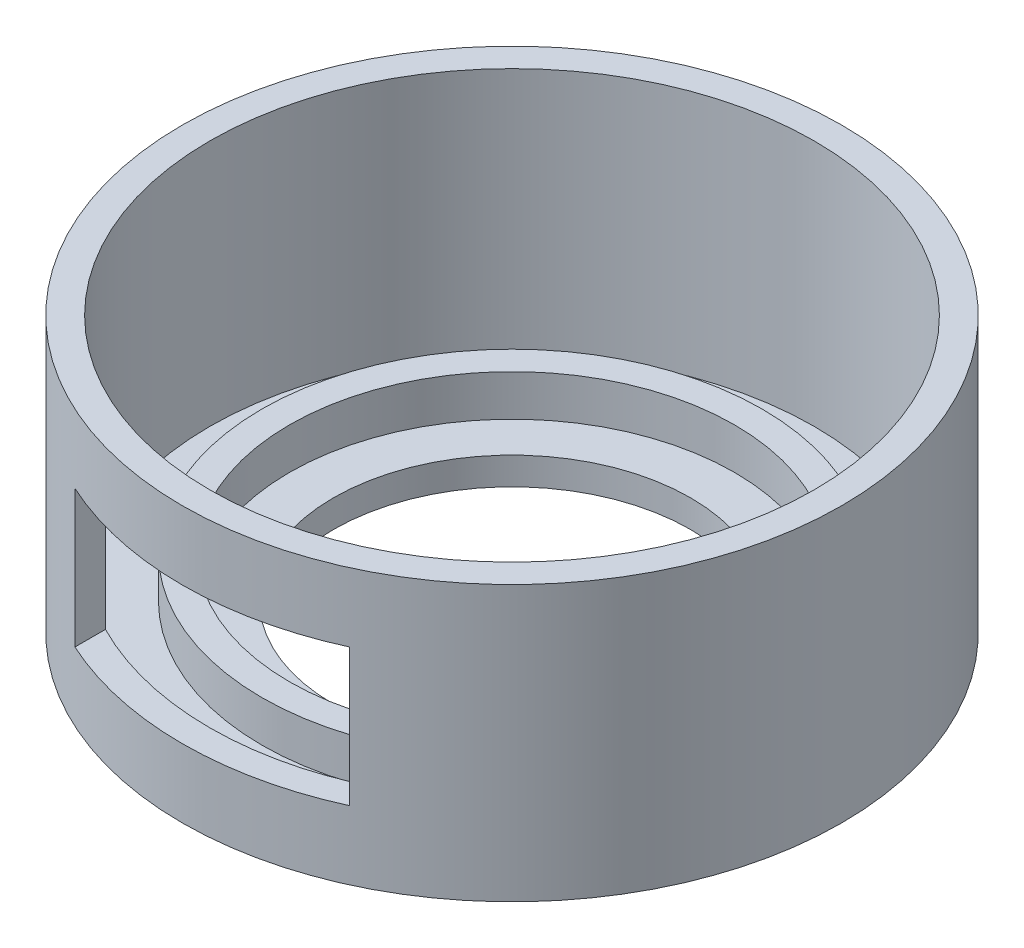
ISO-10303-21;
HEADER;
FILE_DESCRIPTION(('STEP AP214'),'2;1');
FILE_NAME('part.step','',(''),(''),'','','');
FILE_SCHEMA(('AUTOMOTIVE_DESIGN { 1 0 10303 214 1 1 1 1 }'));
ENDSEC;
DATA;
#1=APPLICATION_CONTEXT('core data for automotive mechanical design processes');
#2=APPLICATION_PROTOCOL_DEFINITION('international standard','automotive_design',2000,#1);
#3=PRODUCT_CONTEXT('',#1,'mechanical');
#4=PRODUCT('Part','Part','',(#3));
#5=PRODUCT_RELATED_PRODUCT_CATEGORY('part','',(#4));
#6=PRODUCT_DEFINITION_FORMATION('','',#4);
#7=PRODUCT_DEFINITION_CONTEXT('part definition',#1,'design');
#8=PRODUCT_DEFINITION('design','',#6,#7);
#9=PRODUCT_DEFINITION_SHAPE('','',#8);
#10=(LENGTH_UNIT() NAMED_UNIT(*) SI_UNIT(.MILLI.,.METRE.));
#11=(NAMED_UNIT(*) PLANE_ANGLE_UNIT() SI_UNIT($,.RADIAN.));
#12=(NAMED_UNIT(*) SI_UNIT($,.STERADIAN.) SOLID_ANGLE_UNIT());
#13=UNCERTAINTY_MEASURE_WITH_UNIT(LENGTH_MEASURE(1.E-05),#10,'distance_accuracy_value','');
#14=(GEOMETRIC_REPRESENTATION_CONTEXT(3) GLOBAL_UNCERTAINTY_ASSIGNED_CONTEXT((#13)) GLOBAL_UNIT_ASSIGNED_CONTEXT((#10,
#11,#12)) REPRESENTATION_CONTEXT('',''));
#15=CARTESIAN_POINT('',(0.,0.,0.));
#16=DIRECTION('',(0.,0.,1.));
#17=DIRECTION('',(1.,0.,0.));
#18=AXIS2_PLACEMENT_3D('',#15,#16,#17);
#19=CARTESIAN_POINT('',(8.8,10.,-6.6));
#20=DIRECTION('',(0.,-1.,0.));
#21=DIRECTION('',(0.,0.,-1.));
#22=AXIS2_PLACEMENT_3D('',#19,#20,#21);
#23=CYLINDRICAL_SURFACE('',#22,11.);
#24=CARTESIAN_POINT('',(8.8,0.999999999999999,-6.6));
#25=DIRECTION('',(0.,1.,0.));
#26=DIRECTION('',(0.,0.,1.));
#27=AXIS2_PLACEMENT_3D('',#24,#25,#26);
#28=CIRCLE('',#27,11.);
#29=CARTESIAN_POINT('',(8.8,0.999999999999999,4.4));
#30=VERTEX_POINT('',#29);
#31=EDGE_CURVE('E115',#30,#30,#28,.F.);
#32=ORIENTED_EDGE('',*,*,#31,.T.);
#33=EDGE_LOOP('',(#32));
#34=FACE_BOUND('',#33,.T.);
#35=CARTESIAN_POINT('',(8.8,10.,-6.6));
#36=DIRECTION('',(0.,1.,0.));
#37=DIRECTION('',(0.,0.,1.));
#38=AXIS2_PLACEMENT_3D('',#35,#36,#37);
#39=CIRCLE('',#38,11.);
#40=CARTESIAN_POINT('',(8.8,10.,4.4));
#41=VERTEX_POINT('',#40);
#42=EDGE_CURVE('E122',#41,#41,#39,.T.);
#43=ORIENTED_EDGE('',*,*,#42,.T.);
#44=EDGE_LOOP('',(#43));
#45=FACE_BOUND('',#44,.T.);
#46=DIRECTION('',(0.,-1.,0.));
#47=VECTOR('',#46,1.);
#48=CARTESIAN_POINT('',(3.8,10.,3.19795897113271));
#49=LINE('',#48,#47);
#50=CARTESIAN_POINT('',(3.8,2.5,3.19795897113271));
#51=VERTEX_POINT('',#50);
#52=CARTESIAN_POINT('',(3.8,7.5,3.19795897113271));
#53=VERTEX_POINT('',#52);
#54=EDGE_CURVE('E133',#51,#53,#49,.F.);
#55=ORIENTED_EDGE('',*,*,#54,.F.);
#56=CARTESIAN_POINT('',(8.8,2.5,-6.6));
#57=DIRECTION('',(0.,1.,0.));
#58=DIRECTION('',(0.,0.,1.));
#59=AXIS2_PLACEMENT_3D('',#56,#57,#58);
#60=CIRCLE('',#59,11.);
#61=CARTESIAN_POINT('',(13.8,2.5,3.19795897113271));
#62=VERTEX_POINT('',#61);
#63=EDGE_CURVE('E88',#51,#62,#60,.T.);
#64=ORIENTED_EDGE('',*,*,#63,.T.);
#65=DIRECTION('',(0.,-1.,0.));
#66=VECTOR('',#65,1.);
#67=CARTESIAN_POINT('',(13.8,10.,3.19795897113271));
#68=LINE('',#67,#66);
#69=CARTESIAN_POINT('',(13.8,7.5,3.19795897113271));
#70=VERTEX_POINT('',#69);
#71=EDGE_CURVE('E128',#62,#70,#68,.F.);
#72=ORIENTED_EDGE('',*,*,#71,.T.);
#73=CARTESIAN_POINT('',(8.8,7.5,-6.6));
#74=DIRECTION('',(0.,1.,0.));
#75=DIRECTION('',(0.,0.,1.));
#76=AXIS2_PLACEMENT_3D('',#73,#74,#75);
#77=CIRCLE('',#76,11.);
#78=EDGE_CURVE('E131',#53,#70,#77,.T.);
#79=ORIENTED_EDGE('',*,*,#78,.F.);
#80=EDGE_LOOP('',(#55,#64,#72,#79));
#81=FACE_BOUND('',#80,.T.);
#82=ADVANCED_FACE('F38',(#34,#45,#81),#23,.F.);
#83=CARTESIAN_POINT('',(8.8,10.,-6.6));
#84=DIRECTION('',(0.,-1.,0.));
#85=DIRECTION('',(0.,0.,-1.));
#86=AXIS2_PLACEMENT_3D('',#83,#84,#85);
#87=CYLINDRICAL_SURFACE('',#86,12.);
#88=CARTESIAN_POINT('',(8.8,0.,-6.6));
#89=DIRECTION('',(0.,1.,0.));
#90=DIRECTION('',(0.,0.,1.));
#91=AXIS2_PLACEMENT_3D('',#88,#89,#90);
#92=CIRCLE('',#91,12.);
#93=CARTESIAN_POINT('',(8.8,0.,5.4));
#94=VERTEX_POINT('',#93);
#95=EDGE_CURVE('E119',#94,#94,#92,.T.);
#96=ORIENTED_EDGE('',*,*,#95,.T.);
#97=EDGE_LOOP('',(#96));
#98=FACE_BOUND('',#97,.T.);
#99=CARTESIAN_POINT('',(8.8,10.,-6.6));
#100=DIRECTION('',(0.,1.,0.));
#101=DIRECTION('',(0.,0.,1.));
#102=AXIS2_PLACEMENT_3D('',#99,#100,#101);
#103=CIRCLE('',#102,12.);
#104=CARTESIAN_POINT('',(8.8,10.,5.4));
#105=VERTEX_POINT('',#104);
#106=EDGE_CURVE('E118',#105,#105,#103,.T.);
#107=ORIENTED_EDGE('',*,*,#106,.F.);
#108=EDGE_LOOP('',(#107));
#109=FACE_BOUND('',#108,.T.);
#110=CARTESIAN_POINT('',(8.8,2.5,-6.6));
#111=DIRECTION('',(0.,1.,0.));
#112=DIRECTION('',(0.,0.,1.));
#113=AXIS2_PLACEMENT_3D('',#110,#111,#112);
#114=CIRCLE('',#113,12.);
#115=CARTESIAN_POINT('',(3.8,2.5,4.30871211463571));
#116=VERTEX_POINT('',#115);
#117=CARTESIAN_POINT('',(13.8,2.5,4.30871211463571));
#118=VERTEX_POINT('',#117);
#119=EDGE_CURVE('E11',#116,#118,#114,.T.);
#120=ORIENTED_EDGE('',*,*,#119,.F.);
#121=DIRECTION('',(0.,-1.,0.));
#122=VECTOR('',#121,1.);
#123=CARTESIAN_POINT('',(3.8,10.,4.30871211463571));
#124=LINE('',#123,#122);
#125=CARTESIAN_POINT('',(3.8,7.5,4.30871211463571));
#126=VERTEX_POINT('',#125);
#127=EDGE_CURVE('E75',#116,#126,#124,.F.);
#128=ORIENTED_EDGE('',*,*,#127,.T.);
#129=CARTESIAN_POINT('',(8.8,7.5,-6.6));
#130=DIRECTION('',(0.,1.,0.));
#131=DIRECTION('',(0.,0.,1.));
#132=AXIS2_PLACEMENT_3D('',#129,#130,#131);
#133=CIRCLE('',#132,12.);
#134=CARTESIAN_POINT('',(13.8,7.5,4.30871211463571));
#135=VERTEX_POINT('',#134);
#136=EDGE_CURVE('E80',#126,#135,#133,.T.);
#137=ORIENTED_EDGE('',*,*,#136,.T.);
#138=DIRECTION('',(0.,-1.,0.));
#139=VECTOR('',#138,1.);
#140=CARTESIAN_POINT('',(13.8,10.,4.30871211463571));
#141=LINE('',#140,#139);
#142=EDGE_CURVE('E46',#118,#135,#141,.F.);
#143=ORIENTED_EDGE('',*,*,#142,.F.);
#144=EDGE_LOOP('',(#120,#128,#137,#143));
#145=FACE_BOUND('',#144,.T.);
#146=ADVANCED_FACE('F92',(#98,#109,#145),#87,.T.);
#147=CARTESIAN_POINT('',(0.,1.,0.));
#148=DIRECTION('',(0.,1.,0.));
#149=DIRECTION('',(0.,0.,1.));
#150=AXIS2_PLACEMENT_3D('',#147,#148,#149);
#151=PLANE('',#150);
#152=CARTESIAN_POINT('',(8.8,1.,-6.6));
#153=DIRECTION('',(0.,1.,0.));
#154=DIRECTION('',(0.,0.,1.));
#155=AXIS2_PLACEMENT_3D('',#152,#153,#154);
#156=CIRCLE('',#155,6.5);
#157=CARTESIAN_POINT('',(8.8,1.,-0.0999999999999977));
#158=VERTEX_POINT('',#157);
#159=EDGE_CURVE('E101',#158,#158,#156,.T.);
#160=ORIENTED_EDGE('',*,*,#159,.F.);
#161=EDGE_LOOP('',(#160));
#162=FACE_BOUND('',#161,.T.);
#163=CARTESIAN_POINT('',(8.8,1.,-6.6));
#164=DIRECTION('',(0.,1.,0.));
#165=DIRECTION('',(0.,0.,1.));
#166=AXIS2_PLACEMENT_3D('',#163,#164,#165);
#167=CIRCLE('',#166,8.1);
#168=CARTESIAN_POINT('',(8.8,1.,1.5));
#169=VERTEX_POINT('',#168);
#170=EDGE_CURVE('E81',#169,#169,#167,.F.);
#171=ORIENTED_EDGE('',*,*,#170,.F.);
#172=EDGE_LOOP('',(#171));
#173=FACE_BOUND('',#172,.T.);
#174=ADVANCED_FACE('F159',(#162,#173),#151,.T.);
#175=CARTESIAN_POINT('',(8.8,1.,-6.6));
#176=DIRECTION('',(0.,-1.,0.));
#177=DIRECTION('',(0.,0.,-1.));
#178=AXIS2_PLACEMENT_3D('',#175,#176,#177);
#179=CYLINDRICAL_SURFACE('',#178,6.5);
#180=ORIENTED_EDGE('',*,*,#159,.T.);
#181=EDGE_LOOP('',(#180));
#182=FACE_BOUND('',#181,.T.);
#183=CARTESIAN_POINT('',(8.8,0.,-6.6));
#184=DIRECTION('',(0.,1.,0.));
#185=DIRECTION('',(0.,0.,1.));
#186=AXIS2_PLACEMENT_3D('',#183,#184,#185);
#187=CIRCLE('',#186,6.5);
#188=CARTESIAN_POINT('',(8.8,0.,-0.0999999999999977));
#189=VERTEX_POINT('',#188);
#190=EDGE_CURVE('E98',#189,#189,#187,.T.);
#191=ORIENTED_EDGE('',*,*,#190,.F.);
#192=EDGE_LOOP('',(#191));
#193=FACE_BOUND('',#192,.T.);
#194=ADVANCED_FACE('F40',(#182,#193),#179,.F.);
#195=CARTESIAN_POINT('',(8.8,1.,-6.6));
#196=DIRECTION('',(0.,1.,0.));
#197=DIRECTION('',(0.,0.,1.));
#198=AXIS2_PLACEMENT_3D('',#195,#196,#197);
#199=CIRCLE('',#198,9.1);
#200=CARTESIAN_POINT('',(8.8,1.,2.5));
#201=VERTEX_POINT('',#200);
#202=EDGE_CURVE('E102',#201,#201,#199,.F.);
#203=ORIENTED_EDGE('',*,*,#202,.T.);
#204=EDGE_LOOP('',(#203));
#205=FACE_BOUND('',#204,.T.);
#206=ORIENTED_EDGE('',*,*,#31,.F.);
#207=EDGE_LOOP('',(#206));
#208=FACE_BOUND('',#207,.T.);
#209=ADVANCED_FACE('F178',(#205,#208),#151,.T.);
#210=CARTESIAN_POINT('',(0.,0.,0.));
#211=DIRECTION('',(0.,1.,0.));
#212=DIRECTION('',(0.,0.,1.));
#213=AXIS2_PLACEMENT_3D('',#210,#211,#212);
#214=PLANE('',#213);
#215=ORIENTED_EDGE('',*,*,#190,.T.);
#216=EDGE_LOOP('',(#215));
#217=FACE_BOUND('',#216,.T.);
#218=ORIENTED_EDGE('',*,*,#95,.F.);
#219=EDGE_LOOP('',(#218));
#220=FACE_BOUND('',#219,.T.);
#221=ADVANCED_FACE('F176',(#217,#220),#214,.F.);
#222=CARTESIAN_POINT('',(8.8,2.5,-6.6));
#223=DIRECTION('',(0.,-1.,0.));
#224=DIRECTION('',(0.,0.,-1.));
#225=AXIS2_PLACEMENT_3D('',#222,#223,#224);
#226=CYLINDRICAL_SURFACE('',#225,8.1);
#227=ORIENTED_EDGE('',*,*,#170,.T.);
#228=EDGE_LOOP('',(#227));
#229=FACE_BOUND('',#228,.T.);
#230=CARTESIAN_POINT('',(8.8,2.5,-6.6));
#231=DIRECTION('',(0.,1.,0.));
#232=DIRECTION('',(0.,0.,1.));
#233=AXIS2_PLACEMENT_3D('',#230,#231,#232);
#234=CIRCLE('',#233,8.1);
#235=CARTESIAN_POINT('',(8.8,2.5,1.5));
#236=VERTEX_POINT('',#235);
#237=EDGE_CURVE('E112',#236,#236,#234,.T.);
#238=ORIENTED_EDGE('',*,*,#237,.T.);
#239=EDGE_LOOP('',(#238));
#240=FACE_BOUND('',#239,.T.);
#241=ADVANCED_FACE('F172',(#229,#240),#226,.F.);
#242=CARTESIAN_POINT('',(8.8,2.5,-6.6));
#243=DIRECTION('',(0.,-1.,0.));
#244=DIRECTION('',(0.,0.,-1.));
#245=AXIS2_PLACEMENT_3D('',#242,#243,#244);
#246=CYLINDRICAL_SURFACE('',#245,9.1);
#247=ORIENTED_EDGE('',*,*,#202,.F.);
#248=EDGE_LOOP('',(#247));
#249=FACE_BOUND('',#248,.T.);
#250=CARTESIAN_POINT('',(8.8,2.5,-6.6));
#251=DIRECTION('',(0.,1.,0.));
#252=DIRECTION('',(0.,0.,1.));
#253=AXIS2_PLACEMENT_3D('',#250,#251,#252);
#254=CIRCLE('',#253,9.1);
#255=CARTESIAN_POINT('',(8.8,2.5,2.5));
#256=VERTEX_POINT('',#255);
#257=EDGE_CURVE('E109',#256,#256,#254,.T.);
#258=ORIENTED_EDGE('',*,*,#257,.F.);
#259=EDGE_LOOP('',(#258));
#260=FACE_BOUND('',#259,.T.);
#261=ADVANCED_FACE('F168',(#249,#260),#246,.T.);
#262=CARTESIAN_POINT('',(0.,2.5,0.));
#263=DIRECTION('',(0.,1.,0.));
#264=DIRECTION('',(0.,0.,1.));
#265=AXIS2_PLACEMENT_3D('',#262,#263,#264);
#266=PLANE('',#265);
#267=ORIENTED_EDGE('',*,*,#237,.F.);
#268=EDGE_LOOP('',(#267));
#269=FACE_BOUND('',#268,.T.);
#270=ORIENTED_EDGE('',*,*,#257,.T.);
#271=EDGE_LOOP('',(#270));
#272=FACE_BOUND('',#271,.T.);
#273=ADVANCED_FACE('F165',(#269,#272),#266,.T.);
#274=CARTESIAN_POINT('',(0.,10.,0.));
#275=DIRECTION('',(0.,1.,0.));
#276=DIRECTION('',(0.,0.,1.));
#277=AXIS2_PLACEMENT_3D('',#274,#275,#276);
#278=PLANE('',#277);
#279=ORIENTED_EDGE('',*,*,#42,.F.);
#280=EDGE_LOOP('',(#279));
#281=FACE_BOUND('',#280,.T.);
#282=ORIENTED_EDGE('',*,*,#106,.T.);
#283=EDGE_LOOP('',(#282));
#284=FACE_BOUND('',#283,.T.);
#285=ADVANCED_FACE('F151',(#281,#284),#278,.T.);
#286=CARTESIAN_POINT('',(0.,2.5,30.));
#287=DIRECTION('',(0.,1.,0.));
#288=DIRECTION('',(0.,0.,1.));
#289=AXIS2_PLACEMENT_3D('',#286,#287,#288);
#290=PLANE('',#289);
#291=DIRECTION('',(0.,0.,-1.));
#292=VECTOR('',#291,1.);
#293=CARTESIAN_POINT('',(3.8,2.5,30.));
#294=LINE('',#293,#292);
#295=EDGE_CURVE('E53',#116,#51,#294,.T.);
#296=ORIENTED_EDGE('',*,*,#295,.F.);
#297=ORIENTED_EDGE('',*,*,#119,.T.);
#298=DIRECTION('',(0.,0.,-1.));
#299=VECTOR('',#298,1.);
#300=CARTESIAN_POINT('',(13.8,2.5,30.));
#301=LINE('',#300,#299);
#302=EDGE_CURVE('E135',#118,#62,#301,.T.);
#303=ORIENTED_EDGE('',*,*,#302,.T.);
#304=ORIENTED_EDGE('',*,*,#63,.F.);
#305=EDGE_LOOP('',(#296,#297,#303,#304));
#306=FACE_BOUND('',#305,.T.);
#307=ADVANCED_FACE('F84',(#306),#290,.T.);
#308=CARTESIAN_POINT('',(13.8,0.,30.));
#309=DIRECTION('',(-1.,0.,0.));
#310=DIRECTION('',(0.,0.,1.));
#311=AXIS2_PLACEMENT_3D('',#308,#309,#310);
#312=PLANE('',#311);
#313=ORIENTED_EDGE('',*,*,#302,.F.);
#314=ORIENTED_EDGE('',*,*,#142,.T.);
#315=DIRECTION('',(0.,0.,-1.));
#316=VECTOR('',#315,1.);
#317=CARTESIAN_POINT('',(13.8,7.5,30.));
#318=LINE('',#317,#316);
#319=EDGE_CURVE('E137',#135,#70,#318,.T.);
#320=ORIENTED_EDGE('',*,*,#319,.T.);
#321=ORIENTED_EDGE('',*,*,#71,.F.);
#322=EDGE_LOOP('',(#313,#314,#320,#321));
#323=FACE_BOUND('',#322,.T.);
#324=ADVANCED_FACE('F143',(#323),#312,.T.);
#325=CARTESIAN_POINT('',(0.,7.5,30.));
#326=DIRECTION('',(0.,1.,0.));
#327=DIRECTION('',(0.,0.,1.));
#328=AXIS2_PLACEMENT_3D('',#325,#326,#327);
#329=PLANE('',#328);
#330=ORIENTED_EDGE('',*,*,#78,.T.);
#331=ORIENTED_EDGE('',*,*,#319,.F.);
#332=ORIENTED_EDGE('',*,*,#136,.F.);
#333=DIRECTION('',(0.,0.,-1.));
#334=VECTOR('',#333,1.);
#335=CARTESIAN_POINT('',(3.8,7.5,30.));
#336=LINE('',#335,#334);
#337=EDGE_CURVE('E58',#126,#53,#336,.T.);
#338=ORIENTED_EDGE('',*,*,#337,.T.);
#339=EDGE_LOOP('',(#330,#331,#332,#338));
#340=FACE_BOUND('',#339,.T.);
#341=ADVANCED_FACE('F141',(#340),#329,.F.);
#342=CARTESIAN_POINT('',(3.8,0.,30.));
#343=DIRECTION('',(-1.,0.,0.));
#344=DIRECTION('',(0.,0.,1.));
#345=AXIS2_PLACEMENT_3D('',#342,#343,#344);
#346=PLANE('',#345);
#347=ORIENTED_EDGE('',*,*,#54,.T.);
#348=ORIENTED_EDGE('',*,*,#337,.F.);
#349=ORIENTED_EDGE('',*,*,#127,.F.);
#350=ORIENTED_EDGE('',*,*,#295,.T.);
#351=EDGE_LOOP('',(#347,#348,#349,#350));
#352=FACE_BOUND('',#351,.T.);
#353=ADVANCED_FACE('F76',(#352),#346,.F.);
#354=CLOSED_SHELL('',(#82,#146,#174,#194,#209,#221,#241,#261,#273,#285,#307,#324,#341,#353));
#355=MANIFOLD_SOLID_BREP('B2',#354);
#356=ADVANCED_BREP_SHAPE_REPRESENTATION('',(#18,#355),#14);
#357=SHAPE_DEFINITION_REPRESENTATION(#9,#356);
ENDSEC;
END-ISO-10303-21;
